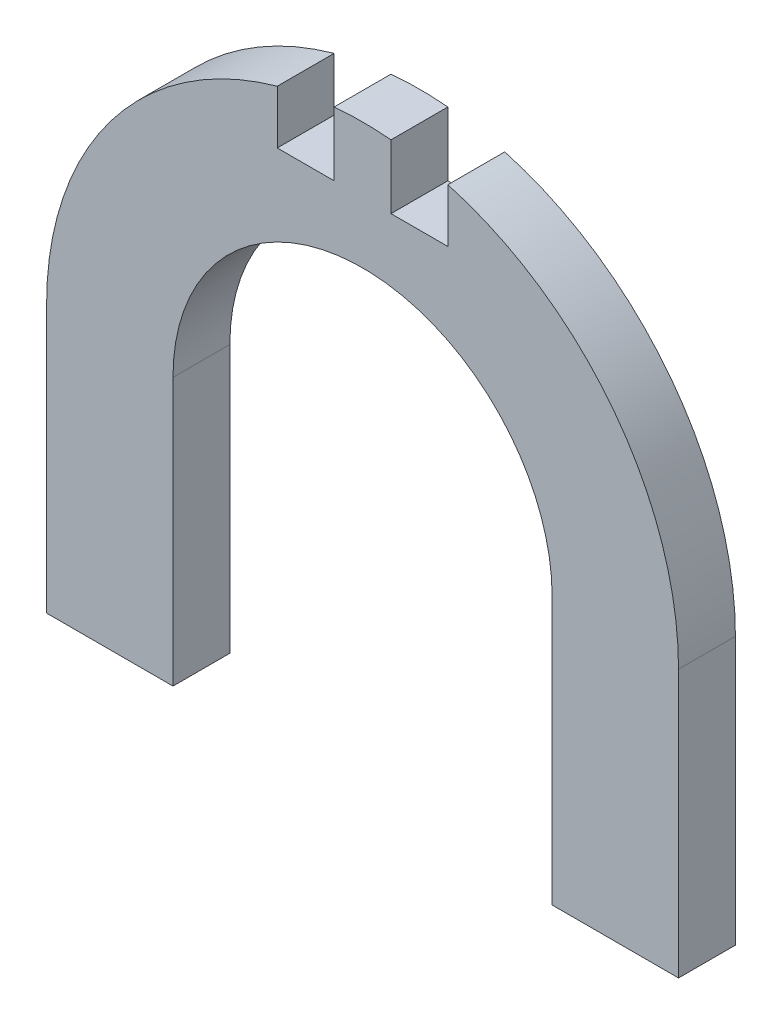
ISO-10303-21;
HEADER;
FILE_DESCRIPTION(('STEP AP214'),'2;1');
FILE_NAME('part.step','',(''),(''),'','','');
FILE_SCHEMA(('AUTOMOTIVE_DESIGN { 1 0 10303 214 1 1 1 1 }'));
ENDSEC;
DATA;
#1=APPLICATION_CONTEXT('core data for automotive mechanical design processes');
#2=APPLICATION_PROTOCOL_DEFINITION('international standard','automotive_design',2000,#1);
#3=PRODUCT_CONTEXT('',#1,'mechanical');
#4=PRODUCT('Part','Part','',(#3));
#5=PRODUCT_RELATED_PRODUCT_CATEGORY('part','',(#4));
#6=PRODUCT_DEFINITION_FORMATION('','',#4);
#7=PRODUCT_DEFINITION_CONTEXT('part definition',#1,'design');
#8=PRODUCT_DEFINITION('design','',#6,#7);
#9=PRODUCT_DEFINITION_SHAPE('','',#8);
#10=(LENGTH_UNIT() NAMED_UNIT(*) SI_UNIT(.MILLI.,.METRE.));
#11=(NAMED_UNIT(*) PLANE_ANGLE_UNIT() SI_UNIT($,.RADIAN.));
#12=(NAMED_UNIT(*) SI_UNIT($,.STERADIAN.) SOLID_ANGLE_UNIT());
#13=UNCERTAINTY_MEASURE_WITH_UNIT(LENGTH_MEASURE(1.E-05),#10,'distance_accuracy_value','');
#14=(GEOMETRIC_REPRESENTATION_CONTEXT(3) GLOBAL_UNCERTAINTY_ASSIGNED_CONTEXT((#13)) GLOBAL_UNIT_ASSIGNED_CONTEXT((#10,
#11,#12)) REPRESENTATION_CONTEXT('',''));
#15=CARTESIAN_POINT('',(0.,0.,0.));
#16=DIRECTION('',(0.,0.,1.));
#17=DIRECTION('',(1.,0.,0.));
#18=AXIS2_PLACEMENT_3D('',#15,#16,#17);
#19=CARTESIAN_POINT('',(8.99974539336768E-12,100.64654763867,18.));
#20=DIRECTION('',(0.,0.,-1.));
#21=DIRECTION('',(-1.,0.,0.));
#22=AXIS2_PLACEMENT_3D('',#19,#20,#21);
#23=CYLINDRICAL_SURFACE('',#22,100.);
#24=CARTESIAN_POINT('',(8.99974539336768E-12,100.64654763867,18.));
#25=DIRECTION('',(0.,0.,1.));
#26=DIRECTION('',(-1.,0.,0.));
#27=AXIS2_PLACEMENT_3D('',#24,#25,#26);
#28=CIRCLE('',#27,100.);
#29=CARTESIAN_POINT('',(9.,200.240724175253,18.));
#30=VERTEX_POINT('',#29);
#31=CARTESIAN_POINT('',(-9.,200.240724175252,18.));
#32=VERTEX_POINT('',#31);
#33=EDGE_CURVE('E244',#30,#32,#28,.T.);
#34=ORIENTED_EDGE('',*,*,#33,.F.);
#35=DIRECTION('',(0.,0.,-1.));
#36=VECTOR('',#35,1.);
#37=CARTESIAN_POINT('',(9.,200.240724175253,18.));
#38=LINE('',#37,#36);
#39=CARTESIAN_POINT('',(9.,200.240724175253,0.));
#40=VERTEX_POINT('',#39);
#41=EDGE_CURVE('E235',#30,#40,#38,.T.);
#42=ORIENTED_EDGE('',*,*,#41,.T.);
#43=CARTESIAN_POINT('',(8.99974539336768E-12,100.64654763867,0.));
#44=DIRECTION('',(0.,0.,1.));
#45=DIRECTION('',(-1.,0.,0.));
#46=AXIS2_PLACEMENT_3D('',#43,#44,#45);
#47=CIRCLE('',#46,100.);
#48=CARTESIAN_POINT('',(-9.,200.240724175252,0.));
#49=VERTEX_POINT('',#48);
#50=EDGE_CURVE('E258',#40,#49,#47,.T.);
#51=ORIENTED_EDGE('',*,*,#50,.T.);
#52=DIRECTION('',(0.,0.,-1.));
#53=VECTOR('',#52,1.);
#54=CARTESIAN_POINT('',(-9.,200.240724175252,18.));
#55=LINE('',#54,#53);
#56=EDGE_CURVE('E229',#49,#32,#55,.F.);
#57=ORIENTED_EDGE('',*,*,#56,.T.);
#58=EDGE_LOOP('',(#34,#42,#51,#57));
#59=FACE_BOUND('',#58,.T.);
#60=ADVANCED_FACE('F37',(#59),#23,.T.);
#61=CARTESIAN_POINT('',(100.000000000009,100.64654763867,0.));
#62=VERTEX_POINT('',#61);
#63=CARTESIAN_POINT('',(27.,196.932579855189,0.));
#64=VERTEX_POINT('',#63);
#65=EDGE_CURVE('E254',#62,#64,#47,.T.);
#66=ORIENTED_EDGE('',*,*,#65,.T.);
#67=DIRECTION('',(0.,0.,-1.));
#68=VECTOR('',#67,1.);
#69=CARTESIAN_POINT('',(27.,196.932579855189,18.));
#70=LINE('',#69,#68);
#71=CARTESIAN_POINT('',(27.,196.932579855189,18.));
#72=VERTEX_POINT('',#71);
#73=EDGE_CURVE('E232',#64,#72,#70,.F.);
#74=ORIENTED_EDGE('',*,*,#73,.T.);
#75=CARTESIAN_POINT('',(100.000000000009,100.64654763867,18.));
#76=VERTEX_POINT('',#75);
#77=EDGE_CURVE('E240',#76,#72,#28,.T.);
#78=ORIENTED_EDGE('',*,*,#77,.F.);
#79=DIRECTION('',(0.,0.,-1.));
#80=VECTOR('',#79,1.);
#81=CARTESIAN_POINT('',(100.000000000009,100.64654763867,18.));
#82=LINE('',#81,#80);
#83=EDGE_CURVE('E270',#76,#62,#82,.T.);
#84=ORIENTED_EDGE('',*,*,#83,.T.);
#85=EDGE_LOOP('',(#66,#74,#78,#84));
#86=FACE_BOUND('',#85,.T.);
#87=ADVANCED_FACE('F316',(#86),#23,.T.);
#88=CARTESIAN_POINT('',(100.,60.,18.));
#89=DIRECTION('',(-1.,0.,0.));
#90=DIRECTION('',(0.,0.,1.));
#91=AXIS2_PLACEMENT_3D('',#88,#89,#90);
#92=PLANE('',#91);
#93=DIRECTION('',(0.,1.,0.));
#94=VECTOR('',#93,1.);
#95=CARTESIAN_POINT('',(100.,60.,0.));
#96=LINE('',#95,#94);
#97=CARTESIAN_POINT('',(100.000000000001,16.0000000000036,0.));
#98=VERTEX_POINT('',#97);
#99=EDGE_CURVE('E169',#98,#62,#96,.T.);
#100=ORIENTED_EDGE('',*,*,#99,.T.);
#101=ORIENTED_EDGE('',*,*,#83,.F.);
#102=DIRECTION('',(0.,1.,0.));
#103=VECTOR('',#102,1.);
#104=CARTESIAN_POINT('',(100.,60.,18.));
#105=LINE('',#104,#103);
#106=CARTESIAN_POINT('',(100.000000000001,16.0000000000036,18.));
#107=VERTEX_POINT('',#106);
#108=EDGE_CURVE('E161',#107,#76,#105,.T.);
#109=ORIENTED_EDGE('',*,*,#108,.F.);
#110=DIRECTION('',(0.,0.,1.));
#111=VECTOR('',#110,1.);
#112=CARTESIAN_POINT('',(100.000000000001,16.0000000000036,18.));
#113=LINE('',#112,#111);
#114=EDGE_CURVE('E173',#98,#107,#113,.T.);
#115=ORIENTED_EDGE('',*,*,#114,.F.);
#116=EDGE_LOOP('',(#100,#101,#109,#115));
#117=FACE_BOUND('',#116,.T.);
#118=ADVANCED_FACE('F39',(#117),#92,.F.);
#119=CARTESIAN_POINT('',(-27.,196.932579855184,18.));
#120=VERTEX_POINT('',#119);
#121=CARTESIAN_POINT('',(-100.000000000001,100.646547638669,18.));
#122=VERTEX_POINT('',#121);
#123=EDGE_CURVE('E239',#120,#122,#28,.T.);
#124=ORIENTED_EDGE('',*,*,#123,.F.);
#125=DIRECTION('',(0.,0.,-1.));
#126=VECTOR('',#125,1.);
#127=CARTESIAN_POINT('',(-27.,196.932579855184,18.));
#128=LINE('',#127,#126);
#129=CARTESIAN_POINT('',(-27.,196.932579855184,0.));
#130=VERTEX_POINT('',#129);
#131=EDGE_CURVE('E211',#120,#130,#128,.T.);
#132=ORIENTED_EDGE('',*,*,#131,.T.);
#133=CARTESIAN_POINT('',(-100.000000000001,100.646547638669,0.));
#134=VERTEX_POINT('',#133);
#135=EDGE_CURVE('E253',#130,#134,#47,.T.);
#136=ORIENTED_EDGE('',*,*,#135,.T.);
#137=DIRECTION('',(0.,0.,-1.));
#138=VECTOR('',#137,1.);
#139=CARTESIAN_POINT('',(-100.000000000001,100.646547638669,18.));
#140=LINE('',#139,#138);
#141=EDGE_CURVE('E267',#122,#134,#140,.T.);
#142=ORIENTED_EDGE('',*,*,#141,.F.);
#143=EDGE_LOOP('',(#124,#132,#136,#142));
#144=FACE_BOUND('',#143,.T.);
#145=ADVANCED_FACE('F279',(#144),#23,.T.);
#146=CARTESIAN_POINT('',(-100.,59.9999999999991,18.));
#147=DIRECTION('',(1.,0.,0.));
#148=DIRECTION('',(0.,1.,0.));
#149=AXIS2_PLACEMENT_3D('',#146,#147,#148);
#150=PLANE('',#149);
#151=DIRECTION('',(0.,-1.,0.));
#152=VECTOR('',#151,1.);
#153=CARTESIAN_POINT('',(-100.,59.9999999999991,0.));
#154=LINE('',#153,#152);
#155=CARTESIAN_POINT('',(-99.9999999999994,15.9999999999991,0.));
#156=VERTEX_POINT('',#155);
#157=EDGE_CURVE('E257',#134,#156,#154,.T.);
#158=ORIENTED_EDGE('',*,*,#157,.T.);
#159=DIRECTION('',(0.,0.,-1.));
#160=VECTOR('',#159,1.);
#161=CARTESIAN_POINT('',(-99.9999999999994,15.9999999999991,18.));
#162=LINE('',#161,#160);
#163=CARTESIAN_POINT('',(-99.9999999999994,15.9999999999991,18.));
#164=VERTEX_POINT('',#163);
#165=EDGE_CURVE('E183',#164,#156,#162,.T.);
#166=ORIENTED_EDGE('',*,*,#165,.F.);
#167=DIRECTION('',(0.,-1.,0.));
#168=VECTOR('',#167,1.);
#169=CARTESIAN_POINT('',(-100.,59.9999999999991,18.));
#170=LINE('',#169,#168);
#171=EDGE_CURVE('E243',#122,#164,#170,.T.);
#172=ORIENTED_EDGE('',*,*,#171,.F.);
#173=ORIENTED_EDGE('',*,*,#141,.T.);
#174=EDGE_LOOP('',(#158,#166,#172,#173));
#175=FACE_BOUND('',#174,.T.);
#176=ADVANCED_FACE('F301',(#175),#150,.F.);
#177=CARTESIAN_POINT('',(-60.0000000000004,60.,18.));
#178=DIRECTION('',(-1.,0.,0.));
#179=DIRECTION('',(0.,-1.,0.));
#180=AXIS2_PLACEMENT_3D('',#177,#178,#179);
#181=PLANE('',#180);
#182=DIRECTION('',(0.,1.,0.));
#183=VECTOR('',#182,1.);
#184=CARTESIAN_POINT('',(-60.0000000000004,60.,0.));
#185=LINE('',#184,#183);
#186=CARTESIAN_POINT('',(-59.9999999999995,16.,0.));
#187=VERTEX_POINT('',#186);
#188=CARTESIAN_POINT('',(-59.9999999999914,100.64654763867,0.));
#189=VERTEX_POINT('',#188);
#190=EDGE_CURVE('E260',#187,#189,#185,.T.);
#191=ORIENTED_EDGE('',*,*,#190,.T.);
#192=DIRECTION('',(0.,0.,-1.));
#193=VECTOR('',#192,1.);
#194=CARTESIAN_POINT('',(-59.9999999999914,100.64654763867,18.));
#195=LINE('',#194,#193);
#196=CARTESIAN_POINT('',(-59.9999999999914,100.64654763867,18.));
#197=VERTEX_POINT('',#196);
#198=EDGE_CURVE('E264',#197,#189,#195,.T.);
#199=ORIENTED_EDGE('',*,*,#198,.F.);
#200=DIRECTION('',(0.,1.,0.));
#201=VECTOR('',#200,1.);
#202=CARTESIAN_POINT('',(-60.0000000000004,60.,18.));
#203=LINE('',#202,#201);
#204=CARTESIAN_POINT('',(-59.9999999999995,16.,18.));
#205=VERTEX_POINT('',#204);
#206=EDGE_CURVE('E246',#205,#197,#203,.T.);
#207=ORIENTED_EDGE('',*,*,#206,.F.);
#208=DIRECTION('',(0.,0.,1.));
#209=VECTOR('',#208,1.);
#210=CARTESIAN_POINT('',(-59.9999999999995,16.,18.));
#211=LINE('',#210,#209);
#212=EDGE_CURVE('E189',#187,#205,#211,.T.);
#213=ORIENTED_EDGE('',*,*,#212,.F.);
#214=EDGE_LOOP('',(#191,#199,#207,#213));
#215=FACE_BOUND('',#214,.T.);
#216=ADVANCED_FACE('F308',(#215),#181,.F.);
#217=CARTESIAN_POINT('',(8.99974539336768E-12,100.64654763867,18.));
#218=DIRECTION('',(0.,0.,-1.));
#219=DIRECTION('',(-1.,0.,0.));
#220=AXIS2_PLACEMENT_3D('',#217,#218,#219);
#221=CYLINDRICAL_SURFACE('',#220,60.0000000000003);
#222=CARTESIAN_POINT('',(8.99974539336768E-12,100.64654763867,0.));
#223=DIRECTION('',(0.,0.,-1.));
#224=DIRECTION('',(1.,0.,0.));
#225=AXIS2_PLACEMENT_3D('',#222,#223,#224);
#226=CIRCLE('',#225,60.0000000000003);
#227=CARTESIAN_POINT('',(60.,100.64654763867,0.));
#228=VERTEX_POINT('',#227);
#229=EDGE_CURVE('E162',#189,#228,#226,.T.);
#230=ORIENTED_EDGE('',*,*,#229,.T.);
#231=DIRECTION('',(0.,0.,-1.));
#232=VECTOR('',#231,1.);
#233=CARTESIAN_POINT('',(60.,100.64654763867,18.));
#234=LINE('',#233,#232);
#235=CARTESIAN_POINT('',(60.,100.64654763867,18.));
#236=VERTEX_POINT('',#235);
#237=EDGE_CURVE('E158',#236,#228,#234,.T.);
#238=ORIENTED_EDGE('',*,*,#237,.F.);
#239=CARTESIAN_POINT('',(8.99974539336768E-12,100.64654763867,18.));
#240=DIRECTION('',(0.,0.,-1.));
#241=DIRECTION('',(1.,0.,0.));
#242=AXIS2_PLACEMENT_3D('',#239,#240,#241);
#243=CIRCLE('',#242,60.0000000000003);
#244=EDGE_CURVE('E248',#197,#236,#243,.T.);
#245=ORIENTED_EDGE('',*,*,#244,.F.);
#246=ORIENTED_EDGE('',*,*,#198,.T.);
#247=EDGE_LOOP('',(#230,#238,#245,#246));
#248=FACE_BOUND('',#247,.T.);
#249=ADVANCED_FACE('F310',(#248),#221,.F.);
#250=CARTESIAN_POINT('',(60.,60.,18.));
#251=DIRECTION('',(1.,0.,0.));
#252=DIRECTION('',(0.,0.,-1.));
#253=AXIS2_PLACEMENT_3D('',#250,#251,#252);
#254=PLANE('',#253);
#255=DIRECTION('',(0.,-1.,0.));
#256=VECTOR('',#255,1.);
#257=CARTESIAN_POINT('',(60.,60.,0.));
#258=LINE('',#257,#256);
#259=CARTESIAN_POINT('',(60.000000000001,16.0000000000027,0.));
#260=VERTEX_POINT('',#259);
#261=EDGE_CURVE('E151',#228,#260,#258,.T.);
#262=ORIENTED_EDGE('',*,*,#261,.T.);
#263=DIRECTION('',(0.,0.,-1.));
#264=VECTOR('',#263,1.);
#265=CARTESIAN_POINT('',(60.000000000001,16.0000000000027,18.));
#266=LINE('',#265,#264);
#267=CARTESIAN_POINT('',(60.000000000001,16.0000000000027,18.));
#268=VERTEX_POINT('',#267);
#269=EDGE_CURVE('E156',#268,#260,#266,.T.);
#270=ORIENTED_EDGE('',*,*,#269,.F.);
#271=DIRECTION('',(0.,-1.,0.));
#272=VECTOR('',#271,1.);
#273=CARTESIAN_POINT('',(60.,60.,18.));
#274=LINE('',#273,#272);
#275=EDGE_CURVE('E250',#236,#268,#274,.T.);
#276=ORIENTED_EDGE('',*,*,#275,.F.);
#277=ORIENTED_EDGE('',*,*,#237,.T.);
#278=EDGE_LOOP('',(#262,#270,#276,#277));
#279=FACE_BOUND('',#278,.T.);
#280=ADVANCED_FACE('F153',(#279),#254,.F.);
#281=CARTESIAN_POINT('',(8.99974539336768E-12,100.64654763867,18.));
#282=DIRECTION('',(0.,0.,-1.));
#283=DIRECTION('',(-1.,0.,0.));
#284=AXIS2_PLACEMENT_3D('',#281,#282,#283);
#285=PLANE('',#284);
#286=DIRECTION('',(1.,0.,0.));
#287=VECTOR('',#286,1.);
#288=CARTESIAN_POINT('',(9.,180.,18.));
#289=LINE('',#288,#287);
#290=CARTESIAN_POINT('',(9.,180.,18.));
#291=VERTEX_POINT('',#290);
#292=CARTESIAN_POINT('',(27.,180.,18.));
#293=VERTEX_POINT('',#292);
#294=EDGE_CURVE('E204',#291,#293,#289,.T.);
#295=ORIENTED_EDGE('',*,*,#294,.F.);
#296=DIRECTION('',(0.,-1.,0.));
#297=VECTOR('',#296,1.);
#298=CARTESIAN_POINT('',(9.,180.,18.));
#299=LINE('',#298,#297);
#300=EDGE_CURVE('E202',#30,#291,#299,.T.);
#301=ORIENTED_EDGE('',*,*,#300,.F.);
#302=ORIENTED_EDGE('',*,*,#33,.T.);
#303=DIRECTION('',(0.,1.,0.));
#304=VECTOR('',#303,1.);
#305=CARTESIAN_POINT('',(-9.,180.,18.));
#306=LINE('',#305,#304);
#307=CARTESIAN_POINT('',(-9.,180.,18.));
#308=VERTEX_POINT('',#307);
#309=EDGE_CURVE('E195',#308,#32,#306,.T.);
#310=ORIENTED_EDGE('',*,*,#309,.F.);
#311=DIRECTION('',(1.,0.,0.));
#312=VECTOR('',#311,1.);
#313=CARTESIAN_POINT('',(-9.,180.,18.));
#314=LINE('',#313,#312);
#315=CARTESIAN_POINT('',(-27.,180.,18.));
#316=VERTEX_POINT('',#315);
#317=EDGE_CURVE('E217',#316,#308,#314,.T.);
#318=ORIENTED_EDGE('',*,*,#317,.F.);
#319=DIRECTION('',(0.,-1.,0.));
#320=VECTOR('',#319,1.);
#321=CARTESIAN_POINT('',(-27.,180.,18.));
#322=LINE('',#321,#320);
#323=EDGE_CURVE('E221',#120,#316,#322,.T.);
#324=ORIENTED_EDGE('',*,*,#323,.F.);
#325=ORIENTED_EDGE('',*,*,#123,.T.);
#326=ORIENTED_EDGE('',*,*,#171,.T.);
#327=DIRECTION('',(-1.,0.,0.));
#328=VECTOR('',#327,1.);
#329=CARTESIAN_POINT('',(-99.9999999999994,15.9999999999991,18.));
#330=LINE('',#329,#328);
#331=EDGE_CURVE('E192',#205,#164,#330,.T.);
#332=ORIENTED_EDGE('',*,*,#331,.F.);
#333=ORIENTED_EDGE('',*,*,#206,.T.);
#334=ORIENTED_EDGE('',*,*,#244,.T.);
#335=ORIENTED_EDGE('',*,*,#275,.T.);
#336=DIRECTION('',(-1.,0.,0.));
#337=VECTOR('',#336,1.);
#338=CARTESIAN_POINT('',(60.000000000001,16.0000000000027,18.));
#339=LINE('',#338,#337);
#340=EDGE_CURVE('E178',#107,#268,#339,.T.);
#341=ORIENTED_EDGE('',*,*,#340,.F.);
#342=ORIENTED_EDGE('',*,*,#108,.T.);
#343=ORIENTED_EDGE('',*,*,#77,.T.);
#344=DIRECTION('',(0.,1.,0.));
#345=VECTOR('',#344,1.);
#346=CARTESIAN_POINT('',(27.,180.,18.));
#347=LINE('',#346,#345);
#348=EDGE_CURVE('E199',#293,#72,#347,.T.);
#349=ORIENTED_EDGE('',*,*,#348,.F.);
#350=EDGE_LOOP('',(#295,#301,#302,#310,#318,#324,#325,#326,#332,#333,#334,#335,#341,#342,#343,#349));
#351=FACE_BOUND('',#350,.T.);
#352=ADVANCED_FACE('F295',(#351),#285,.F.);
#353=CARTESIAN_POINT('',(8.99974539336768E-12,100.64654763867,0.));
#354=DIRECTION('',(0.,0.,-1.));
#355=DIRECTION('',(-1.,0.,0.));
#356=AXIS2_PLACEMENT_3D('',#353,#354,#355);
#357=PLANE('',#356);
#358=DIRECTION('',(0.,1.,0.));
#359=VECTOR('',#358,1.);
#360=CARTESIAN_POINT('',(9.,100.64654763867,0.));
#361=LINE('',#360,#359);
#362=CARTESIAN_POINT('',(9.,180.,0.));
#363=VERTEX_POINT('',#362);
#364=EDGE_CURVE('E11',#363,#40,#361,.T.);
#365=ORIENTED_EDGE('',*,*,#364,.F.);
#366=DIRECTION('',(1.,0.,0.));
#367=VECTOR('',#366,1.);
#368=CARTESIAN_POINT('',(9.,180.,0.));
#369=LINE('',#368,#367);
#370=CARTESIAN_POINT('',(27.,180.,0.));
#371=VERTEX_POINT('',#370);
#372=EDGE_CURVE('E196',#363,#371,#369,.T.);
#373=ORIENTED_EDGE('',*,*,#372,.T.);
#374=DIRECTION('',(0.,1.,0.));
#375=VECTOR('',#374,1.);
#376=CARTESIAN_POINT('',(27.,180.,0.));
#377=LINE('',#376,#375);
#378=EDGE_CURVE('E52',#371,#64,#377,.T.);
#379=ORIENTED_EDGE('',*,*,#378,.T.);
#380=ORIENTED_EDGE('',*,*,#65,.F.);
#381=ORIENTED_EDGE('',*,*,#99,.F.);
#382=DIRECTION('',(1.,0.,0.));
#383=VECTOR('',#382,1.);
#384=CARTESIAN_POINT('',(60.000000000001,16.0000000000027,0.));
#385=LINE('',#384,#383);
#386=EDGE_CURVE('E165',#260,#98,#385,.T.);
#387=ORIENTED_EDGE('',*,*,#386,.F.);
#388=ORIENTED_EDGE('',*,*,#261,.F.);
#389=ORIENTED_EDGE('',*,*,#229,.F.);
#390=ORIENTED_EDGE('',*,*,#190,.F.);
#391=DIRECTION('',(1.,0.,0.));
#392=VECTOR('',#391,1.);
#393=CARTESIAN_POINT('',(-99.9999999999994,15.9999999999991,0.));
#394=LINE('',#393,#392);
#395=EDGE_CURVE('E186',#156,#187,#394,.T.);
#396=ORIENTED_EDGE('',*,*,#395,.F.);
#397=ORIENTED_EDGE('',*,*,#157,.F.);
#398=ORIENTED_EDGE('',*,*,#135,.F.);
#399=DIRECTION('',(0.,1.,0.));
#400=VECTOR('',#399,1.);
#401=CARTESIAN_POINT('',(-27.,100.64654763867,0.));
#402=LINE('',#401,#400);
#403=CARTESIAN_POINT('',(-27.,180.,0.));
#404=VERTEX_POINT('',#403);
#405=EDGE_CURVE('E45',#404,#130,#402,.T.);
#406=ORIENTED_EDGE('',*,*,#405,.F.);
#407=DIRECTION('',(1.,0.,0.));
#408=VECTOR('',#407,1.);
#409=CARTESIAN_POINT('',(-9.,180.,0.));
#410=LINE('',#409,#408);
#411=CARTESIAN_POINT('',(-9.,180.,0.));
#412=VERTEX_POINT('',#411);
#413=EDGE_CURVE('E60',#404,#412,#410,.T.);
#414=ORIENTED_EDGE('',*,*,#413,.T.);
#415=DIRECTION('',(0.,1.,0.));
#416=VECTOR('',#415,1.);
#417=CARTESIAN_POINT('',(-9.,180.,0.));
#418=LINE('',#417,#416);
#419=EDGE_CURVE('E214',#412,#49,#418,.T.);
#420=ORIENTED_EDGE('',*,*,#419,.T.);
#421=ORIENTED_EDGE('',*,*,#50,.F.);
#422=EDGE_LOOP('',(#365,#373,#379,#380,#381,#387,#388,#389,#390,#396,#397,#398,#406,#414,#420,#421));
#423=FACE_BOUND('',#422,.T.);
#424=ADVANCED_FACE('F167',(#423),#357,.T.);
#425=CARTESIAN_POINT('',(-9.,180.,0.));
#426=DIRECTION('',(1.,0.,0.));
#427=DIRECTION('',(0.,0.,-1.));
#428=AXIS2_PLACEMENT_3D('',#425,#426,#427);
#429=PLANE('',#428);
#430=ORIENTED_EDGE('',*,*,#419,.F.);
#431=DIRECTION('',(0.,0.,1.));
#432=VECTOR('',#431,1.);
#433=CARTESIAN_POINT('',(-9.,180.,0.));
#434=LINE('',#433,#432);
#435=EDGE_CURVE('E205',#412,#308,#434,.T.);
#436=ORIENTED_EDGE('',*,*,#435,.T.);
#437=ORIENTED_EDGE('',*,*,#309,.T.);
#438=ORIENTED_EDGE('',*,*,#56,.F.);
#439=EDGE_LOOP('',(#430,#436,#437,#438));
#440=FACE_BOUND('',#439,.T.);
#441=ADVANCED_FACE('F290',(#440),#429,.F.);
#442=CARTESIAN_POINT('',(-27.,180.,0.));
#443=DIRECTION('',(-1.,0.,0.));
#444=DIRECTION('',(0.,0.,1.));
#445=AXIS2_PLACEMENT_3D('',#442,#443,#444);
#446=PLANE('',#445);
#447=ORIENTED_EDGE('',*,*,#323,.T.);
#448=DIRECTION('',(0.,0.,1.));
#449=VECTOR('',#448,1.);
#450=CARTESIAN_POINT('',(-27.,180.,0.));
#451=LINE('',#450,#449);
#452=EDGE_CURVE('E219',#404,#316,#451,.T.);
#453=ORIENTED_EDGE('',*,*,#452,.F.);
#454=ORIENTED_EDGE('',*,*,#405,.T.);
#455=ORIENTED_EDGE('',*,*,#131,.F.);
#456=EDGE_LOOP('',(#447,#453,#454,#455));
#457=FACE_BOUND('',#456,.T.);
#458=ADVANCED_FACE('F274',(#457),#446,.F.);
#459=CARTESIAN_POINT('',(-9.,180.,0.));
#460=DIRECTION('',(0.,-1.,0.));
#461=DIRECTION('',(0.,0.,-1.));
#462=AXIS2_PLACEMENT_3D('',#459,#460,#461);
#463=PLANE('',#462);
#464=ORIENTED_EDGE('',*,*,#317,.T.);
#465=ORIENTED_EDGE('',*,*,#435,.F.);
#466=ORIENTED_EDGE('',*,*,#413,.F.);
#467=ORIENTED_EDGE('',*,*,#452,.T.);
#468=EDGE_LOOP('',(#464,#465,#466,#467));
#469=FACE_BOUND('',#468,.T.);
#470=ADVANCED_FACE('F324',(#469),#463,.F.);
#471=CARTESIAN_POINT('',(9.,180.,0.));
#472=DIRECTION('',(-1.,0.,0.));
#473=DIRECTION('',(0.,0.,1.));
#474=AXIS2_PLACEMENT_3D('',#471,#472,#473);
#475=PLANE('',#474);
#476=ORIENTED_EDGE('',*,*,#300,.T.);
#477=DIRECTION('',(0.,0.,1.));
#478=VECTOR('',#477,1.);
#479=CARTESIAN_POINT('',(9.,180.,0.));
#480=LINE('',#479,#478);
#481=EDGE_CURVE('E201',#363,#291,#480,.T.);
#482=ORIENTED_EDGE('',*,*,#481,.F.);
#483=ORIENTED_EDGE('',*,*,#364,.T.);
#484=ORIENTED_EDGE('',*,*,#41,.F.);
#485=EDGE_LOOP('',(#476,#482,#483,#484));
#486=FACE_BOUND('',#485,.T.);
#487=ADVANCED_FACE('F322',(#486),#475,.F.);
#488=CARTESIAN_POINT('',(27.,180.,0.));
#489=DIRECTION('',(1.,0.,0.));
#490=DIRECTION('',(0.,0.,-1.));
#491=AXIS2_PLACEMENT_3D('',#488,#489,#490);
#492=PLANE('',#491);
#493=ORIENTED_EDGE('',*,*,#378,.F.);
#494=DIRECTION('',(0.,0.,1.));
#495=VECTOR('',#494,1.);
#496=CARTESIAN_POINT('',(27.,180.,0.));
#497=LINE('',#496,#495);
#498=EDGE_CURVE('E209',#371,#293,#497,.T.);
#499=ORIENTED_EDGE('',*,*,#498,.T.);
#500=ORIENTED_EDGE('',*,*,#348,.T.);
#501=ORIENTED_EDGE('',*,*,#73,.F.);
#502=EDGE_LOOP('',(#493,#499,#500,#501));
#503=FACE_BOUND('',#502,.T.);
#504=ADVANCED_FACE('F317',(#503),#492,.F.);
#505=CARTESIAN_POINT('',(9.,180.,0.));
#506=DIRECTION('',(0.,-1.,0.));
#507=DIRECTION('',(0.,0.,-1.));
#508=AXIS2_PLACEMENT_3D('',#505,#506,#507);
#509=PLANE('',#508);
#510=ORIENTED_EDGE('',*,*,#294,.T.);
#511=ORIENTED_EDGE('',*,*,#498,.F.);
#512=ORIENTED_EDGE('',*,*,#372,.F.);
#513=ORIENTED_EDGE('',*,*,#481,.T.);
#514=EDGE_LOOP('',(#510,#511,#512,#513));
#515=FACE_BOUND('',#514,.T.);
#516=ADVANCED_FACE('F320',(#515),#509,.F.);
#517=CARTESIAN_POINT('',(-3.5527136788008E-13,16.0000000000013,0.));
#518=DIRECTION('',(0.,-1.,0.));
#519=DIRECTION('',(1.,0.,0.));
#520=AXIS2_PLACEMENT_3D('',#517,#518,#519);
#521=PLANE('',#520);
#522=ORIENTED_EDGE('',*,*,#165,.T.);
#523=ORIENTED_EDGE('',*,*,#395,.T.);
#524=ORIENTED_EDGE('',*,*,#212,.T.);
#525=ORIENTED_EDGE('',*,*,#331,.T.);
#526=EDGE_LOOP('',(#522,#523,#524,#525));
#527=FACE_BOUND('',#526,.T.);
#528=ADVANCED_FACE('F303',(#527),#521,.T.);
#529=CARTESIAN_POINT('',(-3.5527136788008E-13,16.0000000000013,0.));
#530=DIRECTION('',(0.,-1.,0.));
#531=DIRECTION('',(1.,0.,0.));
#532=AXIS2_PLACEMENT_3D('',#529,#530,#531);
#533=PLANE('',#532);
#534=ORIENTED_EDGE('',*,*,#269,.T.);
#535=ORIENTED_EDGE('',*,*,#386,.T.);
#536=ORIENTED_EDGE('',*,*,#114,.T.);
#537=ORIENTED_EDGE('',*,*,#340,.T.);
#538=EDGE_LOOP('',(#534,#535,#536,#537));
#539=FACE_BOUND('',#538,.T.);
#540=ADVANCED_FACE('F176',(#539),#533,.T.);
#541=CLOSED_SHELL('',(#60,#87,#118,#145,#176,#216,#249,#280,#352,#424,#441,#458,#470,#487,#504,
#516,#528,#540));
#542=MANIFOLD_SOLID_BREP('B2',#541);
#543=ADVANCED_BREP_SHAPE_REPRESENTATION('',(#18,#542),#14);
#544=SHAPE_DEFINITION_REPRESENTATION(#9,#543);
ENDSEC;
END-ISO-10303-21;
